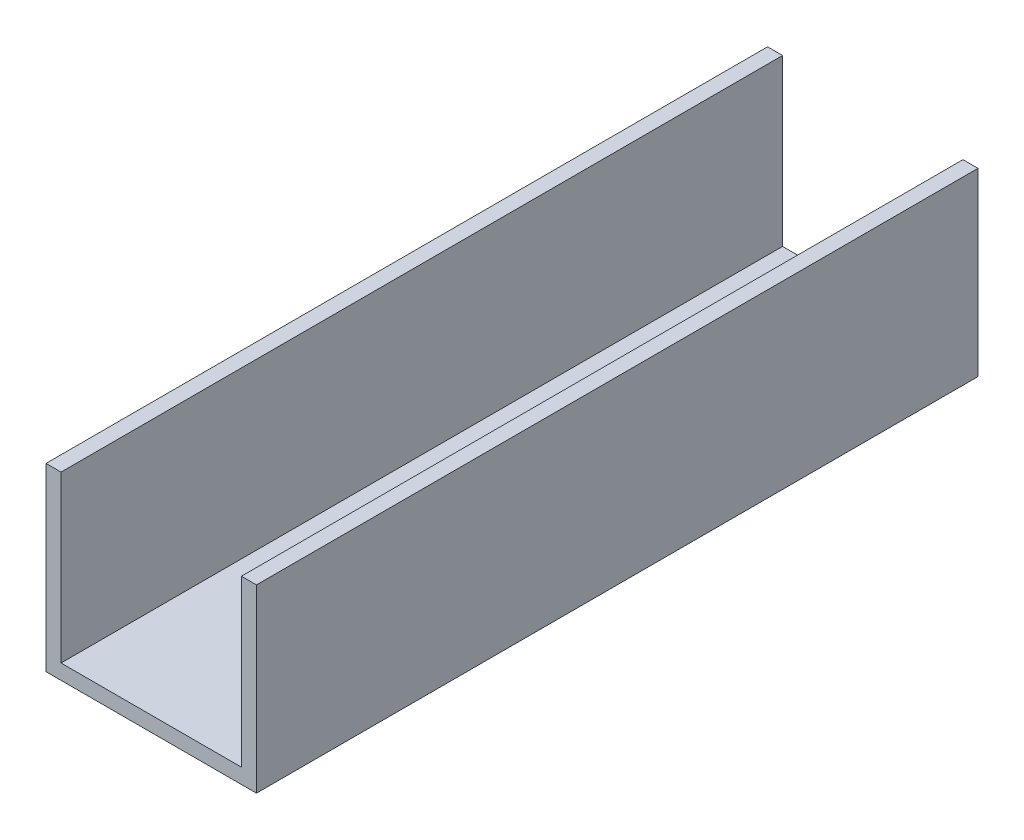
ISO-10303-21;
HEADER;
FILE_DESCRIPTION(('STEP AP214'),'2;1');
FILE_NAME('part.step','',(''),(''),'','','');
FILE_SCHEMA(('AUTOMOTIVE_DESIGN { 1 0 10303 214 1 1 1 1 }'));
ENDSEC;
DATA;
#1=APPLICATION_CONTEXT('core data for automotive mechanical design processes');
#2=APPLICATION_PROTOCOL_DEFINITION('international standard','automotive_design',2000,#1);
#3=PRODUCT_CONTEXT('',#1,'mechanical');
#4=PRODUCT('Part','Part','',(#3));
#5=PRODUCT_RELATED_PRODUCT_CATEGORY('part','',(#4));
#6=PRODUCT_DEFINITION_FORMATION('','',#4);
#7=PRODUCT_DEFINITION_CONTEXT('part definition',#1,'design');
#8=PRODUCT_DEFINITION('design','',#6,#7);
#9=PRODUCT_DEFINITION_SHAPE('','',#8);
#10=(LENGTH_UNIT() NAMED_UNIT(*) SI_UNIT(.MILLI.,.METRE.));
#11=(NAMED_UNIT(*) PLANE_ANGLE_UNIT() SI_UNIT($,.RADIAN.));
#12=(NAMED_UNIT(*) SI_UNIT($,.STERADIAN.) SOLID_ANGLE_UNIT());
#13=UNCERTAINTY_MEASURE_WITH_UNIT(LENGTH_MEASURE(1.E-05),#10,'distance_accuracy_value','');
#14=(GEOMETRIC_REPRESENTATION_CONTEXT(3) GLOBAL_UNCERTAINTY_ASSIGNED_CONTEXT((#13)) GLOBAL_UNIT_ASSIGNED_CONTEXT((#10,
#11,#12)) REPRESENTATION_CONTEXT('',''));
#15=CARTESIAN_POINT('',(0.,0.,0.));
#16=DIRECTION('',(0.,0.,1.));
#17=DIRECTION('',(1.,0.,0.));
#18=AXIS2_PLACEMENT_3D('',#15,#16,#17);
#19=CARTESIAN_POINT('',(-22.225,38.1,-152.4));
#20=DIRECTION('',(-1.,0.,0.));
#21=DIRECTION('',(0.,-1.,0.));
#22=AXIS2_PLACEMENT_3D('',#19,#20,#21);
#23=PLANE('',#22);
#24=DIRECTION('',(0.,-1.,0.));
#25=VECTOR('',#24,1.);
#26=CARTESIAN_POINT('',(-22.225,38.1,0.));
#27=LINE('',#26,#25);
#28=CARTESIAN_POINT('',(-22.225,38.1,0.));
#29=VERTEX_POINT('',#28);
#30=CARTESIAN_POINT('',(-22.225,0.,0.));
#31=VERTEX_POINT('',#30);
#32=EDGE_CURVE('E130',#29,#31,#27,.T.);
#33=ORIENTED_EDGE('',*,*,#32,.F.);
#34=DIRECTION('',(0.,0.,1.));
#35=VECTOR('',#34,1.);
#36=CARTESIAN_POINT('',(-22.225,38.1,-152.4));
#37=LINE('',#36,#35);
#38=CARTESIAN_POINT('',(-22.225,38.1,-152.4));
#39=VERTEX_POINT('',#38);
#40=EDGE_CURVE('E11',#39,#29,#37,.T.);
#41=ORIENTED_EDGE('',*,*,#40,.F.);
#42=DIRECTION('',(0.,-1.,0.));
#43=VECTOR('',#42,1.);
#44=CARTESIAN_POINT('',(-22.225,38.1,-152.4));
#45=LINE('',#44,#43);
#46=CARTESIAN_POINT('',(-22.225,0.,-152.4));
#47=VERTEX_POINT('',#46);
#48=EDGE_CURVE('E150',#39,#47,#45,.T.);
#49=ORIENTED_EDGE('',*,*,#48,.T.);
#50=DIRECTION('',(0.,0.,1.));
#51=VECTOR('',#50,1.);
#52=CARTESIAN_POINT('',(-22.225,0.,-152.4));
#53=LINE('',#52,#51);
#54=EDGE_CURVE('E36',#47,#31,#53,.T.);
#55=ORIENTED_EDGE('',*,*,#54,.T.);
#56=EDGE_LOOP('',(#33,#41,#49,#55));
#57=FACE_BOUND('',#56,.T.);
#58=ADVANCED_FACE('F33',(#57),#23,.T.);
#59=CARTESIAN_POINT('',(-22.225,38.1,-152.4));
#60=DIRECTION('',(0.,1.,0.));
#61=DIRECTION('',(0.,0.,1.));
#62=AXIS2_PLACEMENT_3D('',#59,#60,#61);
#63=PLANE('',#62);
#64=DIRECTION('',(-1.,0.,0.));
#65=VECTOR('',#64,1.);
#66=CARTESIAN_POINT('',(-22.225,38.1,0.));
#67=LINE('',#66,#65);
#68=CARTESIAN_POINT('',(-19.05,38.1,0.));
#69=VERTEX_POINT('',#68);
#70=EDGE_CURVE('E148',#69,#29,#67,.T.);
#71=ORIENTED_EDGE('',*,*,#70,.F.);
#72=DIRECTION('',(0.,0.,1.));
#73=VECTOR('',#72,1.);
#74=CARTESIAN_POINT('',(-19.05,38.1,-152.4));
#75=LINE('',#74,#73);
#76=CARTESIAN_POINT('',(-19.05,38.1,-152.4));
#77=VERTEX_POINT('',#76);
#78=EDGE_CURVE('E42',#77,#69,#75,.T.);
#79=ORIENTED_EDGE('',*,*,#78,.F.);
#80=DIRECTION('',(-1.,0.,0.));
#81=VECTOR('',#80,1.);
#82=CARTESIAN_POINT('',(-22.225,38.1,-152.4));
#83=LINE('',#82,#81);
#84=EDGE_CURVE('E120',#77,#39,#83,.T.);
#85=ORIENTED_EDGE('',*,*,#84,.T.);
#86=ORIENTED_EDGE('',*,*,#40,.T.);
#87=EDGE_LOOP('',(#71,#79,#85,#86));
#88=FACE_BOUND('',#87,.T.);
#89=ADVANCED_FACE('F162',(#88),#63,.T.);
#90=CARTESIAN_POINT('',(-19.05,38.1,-152.4));
#91=DIRECTION('',(1.,0.,0.));
#92=DIRECTION('',(0.,0.,-1.));
#93=AXIS2_PLACEMENT_3D('',#90,#91,#92);
#94=PLANE('',#93);
#95=DIRECTION('',(0.,1.,0.));
#96=VECTOR('',#95,1.);
#97=CARTESIAN_POINT('',(-19.05,38.1,0.));
#98=LINE('',#97,#96);
#99=CARTESIAN_POINT('',(-19.05,3.175,0.));
#100=VERTEX_POINT('',#99);
#101=EDGE_CURVE('E107',#100,#69,#98,.T.);
#102=ORIENTED_EDGE('',*,*,#101,.F.);
#103=DIRECTION('',(0.,0.,1.));
#104=VECTOR('',#103,1.);
#105=CARTESIAN_POINT('',(-19.05,3.175,-152.4));
#106=LINE('',#105,#104);
#107=CARTESIAN_POINT('',(-19.05,3.175,-152.4));
#108=VERTEX_POINT('',#107);
#109=EDGE_CURVE('E102',#108,#100,#106,.T.);
#110=ORIENTED_EDGE('',*,*,#109,.F.);
#111=DIRECTION('',(0.,1.,0.));
#112=VECTOR('',#111,1.);
#113=CARTESIAN_POINT('',(-19.05,38.1,-152.4));
#114=LINE('',#113,#112);
#115=EDGE_CURVE('E105',#108,#77,#114,.T.);
#116=ORIENTED_EDGE('',*,*,#115,.T.);
#117=ORIENTED_EDGE('',*,*,#78,.T.);
#118=EDGE_LOOP('',(#102,#110,#116,#117));
#119=FACE_BOUND('',#118,.T.);
#120=ADVANCED_FACE('F104',(#119),#94,.T.);
#121=CARTESIAN_POINT('',(-19.05,3.175,-152.4));
#122=DIRECTION('',(0.,1.,0.));
#123=DIRECTION('',(0.,0.,1.));
#124=AXIS2_PLACEMENT_3D('',#121,#122,#123);
#125=PLANE('',#124);
#126=DIRECTION('',(-1.,0.,0.));
#127=VECTOR('',#126,1.);
#128=CARTESIAN_POINT('',(-19.05,3.175,0.));
#129=LINE('',#128,#127);
#130=CARTESIAN_POINT('',(19.05,3.175,0.));
#131=VERTEX_POINT('',#130);
#132=EDGE_CURVE('E145',#131,#100,#129,.T.);
#133=ORIENTED_EDGE('',*,*,#132,.F.);
#134=DIRECTION('',(0.,0.,1.));
#135=VECTOR('',#134,1.);
#136=CARTESIAN_POINT('',(19.05,3.175,-152.4));
#137=LINE('',#136,#135);
#138=CARTESIAN_POINT('',(19.05,3.175,-152.4));
#139=VERTEX_POINT('',#138);
#140=EDGE_CURVE('E112',#139,#131,#137,.T.);
#141=ORIENTED_EDGE('',*,*,#140,.F.);
#142=DIRECTION('',(-1.,0.,0.));
#143=VECTOR('',#142,1.);
#144=CARTESIAN_POINT('',(-19.05,3.175,-152.4));
#145=LINE('',#144,#143);
#146=EDGE_CURVE('E118',#139,#108,#145,.T.);
#147=ORIENTED_EDGE('',*,*,#146,.T.);
#148=ORIENTED_EDGE('',*,*,#109,.T.);
#149=EDGE_LOOP('',(#133,#141,#147,#148));
#150=FACE_BOUND('',#149,.T.);
#151=ADVANCED_FACE('F122',(#150),#125,.T.);
#152=CARTESIAN_POINT('',(19.05,38.1,-152.4));
#153=DIRECTION('',(-1.,0.,0.));
#154=DIRECTION('',(0.,0.,1.));
#155=AXIS2_PLACEMENT_3D('',#152,#153,#154);
#156=PLANE('',#155);
#157=DIRECTION('',(0.,-1.,0.));
#158=VECTOR('',#157,1.);
#159=CARTESIAN_POINT('',(19.05,38.1,0.));
#160=LINE('',#159,#158);
#161=CARTESIAN_POINT('',(19.05,38.1,0.));
#162=VERTEX_POINT('',#161);
#163=EDGE_CURVE('E142',#162,#131,#160,.T.);
#164=ORIENTED_EDGE('',*,*,#163,.F.);
#165=DIRECTION('',(0.,0.,1.));
#166=VECTOR('',#165,1.);
#167=CARTESIAN_POINT('',(19.05,38.1,-152.4));
#168=LINE('',#167,#166);
#169=CARTESIAN_POINT('',(19.05,38.1,-152.4));
#170=VERTEX_POINT('',#169);
#171=EDGE_CURVE('E154',#170,#162,#168,.T.);
#172=ORIENTED_EDGE('',*,*,#171,.F.);
#173=DIRECTION('',(0.,-1.,0.));
#174=VECTOR('',#173,1.);
#175=CARTESIAN_POINT('',(19.05,38.1,-152.4));
#176=LINE('',#175,#174);
#177=EDGE_CURVE('E123',#170,#139,#176,.T.);
#178=ORIENTED_EDGE('',*,*,#177,.T.);
#179=ORIENTED_EDGE('',*,*,#140,.T.);
#180=EDGE_LOOP('',(#164,#172,#178,#179));
#181=FACE_BOUND('',#180,.T.);
#182=ADVANCED_FACE('F175',(#181),#156,.T.);
#183=CARTESIAN_POINT('',(19.05,38.1,-152.4));
#184=DIRECTION('',(0.,1.,0.));
#185=DIRECTION('',(0.,0.,1.));
#186=AXIS2_PLACEMENT_3D('',#183,#184,#185);
#187=PLANE('',#186);
#188=DIRECTION('',(-1.,0.,0.));
#189=VECTOR('',#188,1.);
#190=CARTESIAN_POINT('',(19.05,38.1,0.));
#191=LINE('',#190,#189);
#192=CARTESIAN_POINT('',(22.225,38.1,0.));
#193=VERTEX_POINT('',#192);
#194=EDGE_CURVE('E139',#193,#162,#191,.T.);
#195=ORIENTED_EDGE('',*,*,#194,.F.);
#196=DIRECTION('',(0.,0.,1.));
#197=VECTOR('',#196,1.);
#198=CARTESIAN_POINT('',(22.225,38.1,-152.4));
#199=LINE('',#198,#197);
#200=CARTESIAN_POINT('',(22.225,38.1,-152.4));
#201=VERTEX_POINT('',#200);
#202=EDGE_CURVE('E156',#201,#193,#199,.T.);
#203=ORIENTED_EDGE('',*,*,#202,.F.);
#204=DIRECTION('',(-1.,0.,0.));
#205=VECTOR('',#204,1.);
#206=CARTESIAN_POINT('',(19.05,38.1,-152.4));
#207=LINE('',#206,#205);
#208=EDGE_CURVE('E125',#201,#170,#207,.T.);
#209=ORIENTED_EDGE('',*,*,#208,.T.);
#210=ORIENTED_EDGE('',*,*,#171,.T.);
#211=EDGE_LOOP('',(#195,#203,#209,#210));
#212=FACE_BOUND('',#211,.T.);
#213=ADVANCED_FACE('F178',(#212),#187,.T.);
#214=CARTESIAN_POINT('',(22.225,38.1,-152.4));
#215=DIRECTION('',(1.,0.,0.));
#216=DIRECTION('',(0.,1.,0.));
#217=AXIS2_PLACEMENT_3D('',#214,#215,#216);
#218=PLANE('',#217);
#219=DIRECTION('',(0.,1.,0.));
#220=VECTOR('',#219,1.);
#221=CARTESIAN_POINT('',(22.225,38.1,0.));
#222=LINE('',#221,#220);
#223=CARTESIAN_POINT('',(22.225,0.,0.));
#224=VERTEX_POINT('',#223);
#225=EDGE_CURVE('E136',#224,#193,#222,.T.);
#226=ORIENTED_EDGE('',*,*,#225,.F.);
#227=DIRECTION('',(0.,0.,1.));
#228=VECTOR('',#227,1.);
#229=CARTESIAN_POINT('',(22.225,0.,-152.4));
#230=LINE('',#229,#228);
#231=CARTESIAN_POINT('',(22.225,0.,-152.4));
#232=VERTEX_POINT('',#231);
#233=EDGE_CURVE('E157',#232,#224,#230,.T.);
#234=ORIENTED_EDGE('',*,*,#233,.F.);
#235=DIRECTION('',(0.,1.,0.));
#236=VECTOR('',#235,1.);
#237=CARTESIAN_POINT('',(22.225,38.1,-152.4));
#238=LINE('',#237,#236);
#239=EDGE_CURVE('E253',#232,#201,#238,.T.);
#240=ORIENTED_EDGE('',*,*,#239,.T.);
#241=ORIENTED_EDGE('',*,*,#202,.T.);
#242=EDGE_LOOP('',(#226,#234,#240,#241));
#243=FACE_BOUND('',#242,.T.);
#244=ADVANCED_FACE('F182',(#243),#218,.T.);
#245=CARTESIAN_POINT('',(-22.225,0.,-152.4));
#246=DIRECTION('',(0.,-1.,0.));
#247=DIRECTION('',(0.,0.,-1.));
#248=AXIS2_PLACEMENT_3D('',#245,#246,#247);
#249=PLANE('',#248);
#250=DIRECTION('',(1.,0.,0.));
#251=VECTOR('',#250,1.);
#252=CARTESIAN_POINT('',(-22.225,0.,0.));
#253=LINE('',#252,#251);
#254=EDGE_CURVE('E133',#31,#224,#253,.T.);
#255=ORIENTED_EDGE('',*,*,#254,.F.);
#256=ORIENTED_EDGE('',*,*,#54,.F.);
#257=DIRECTION('',(1.,0.,0.));
#258=VECTOR('',#257,1.);
#259=CARTESIAN_POINT('',(-22.225,0.,-152.4));
#260=LINE('',#259,#258);
#261=EDGE_CURVE('E254',#47,#232,#260,.T.);
#262=ORIENTED_EDGE('',*,*,#261,.T.);
#263=ORIENTED_EDGE('',*,*,#233,.T.);
#264=EDGE_LOOP('',(#255,#256,#262,#263));
#265=FACE_BOUND('',#264,.T.);
#266=ADVANCED_FACE('F159',(#265),#249,.T.);
#267=CARTESIAN_POINT('',(0.,0.,-152.4));
#268=DIRECTION('',(0.,0.,1.));
#269=DIRECTION('',(1.,0.,0.));
#270=AXIS2_PLACEMENT_3D('',#267,#268,#269);
#271=PLANE('',#270);
#272=ORIENTED_EDGE('',*,*,#48,.F.);
#273=ORIENTED_EDGE('',*,*,#84,.F.);
#274=ORIENTED_EDGE('',*,*,#115,.F.);
#275=ORIENTED_EDGE('',*,*,#146,.F.);
#276=ORIENTED_EDGE('',*,*,#177,.F.);
#277=ORIENTED_EDGE('',*,*,#208,.F.);
#278=ORIENTED_EDGE('',*,*,#239,.F.);
#279=ORIENTED_EDGE('',*,*,#261,.F.);
#280=EDGE_LOOP('',(#272,#273,#274,#275,#276,#277,#278,#279));
#281=FACE_BOUND('',#280,.T.);
#282=ADVANCED_FACE('F116',(#281),#271,.F.);
#283=CARTESIAN_POINT('',(0.,0.,0.));
#284=DIRECTION('',(0.,0.,1.));
#285=DIRECTION('',(1.,0.,0.));
#286=AXIS2_PLACEMENT_3D('',#283,#284,#285);
#287=PLANE('',#286);
#288=ORIENTED_EDGE('',*,*,#32,.T.);
#289=ORIENTED_EDGE('',*,*,#254,.T.);
#290=ORIENTED_EDGE('',*,*,#225,.T.);
#291=ORIENTED_EDGE('',*,*,#194,.T.);
#292=ORIENTED_EDGE('',*,*,#163,.T.);
#293=ORIENTED_EDGE('',*,*,#132,.T.);
#294=ORIENTED_EDGE('',*,*,#101,.T.);
#295=ORIENTED_EDGE('',*,*,#70,.T.);
#296=EDGE_LOOP('',(#288,#289,#290,#291,#292,#293,#294,#295));
#297=FACE_BOUND('',#296,.T.);
#298=ADVANCED_FACE('F161',(#297),#287,.T.);
#299=CLOSED_SHELL('',(#58,#89,#120,#151,#182,#213,#244,#266,#282,#298));
#300=MANIFOLD_SOLID_BREP('B2',#299);
#301=ADVANCED_BREP_SHAPE_REPRESENTATION('',(#18,#300),#14);
#302=SHAPE_DEFINITION_REPRESENTATION(#9,#301);
ENDSEC;
END-ISO-10303-21;
